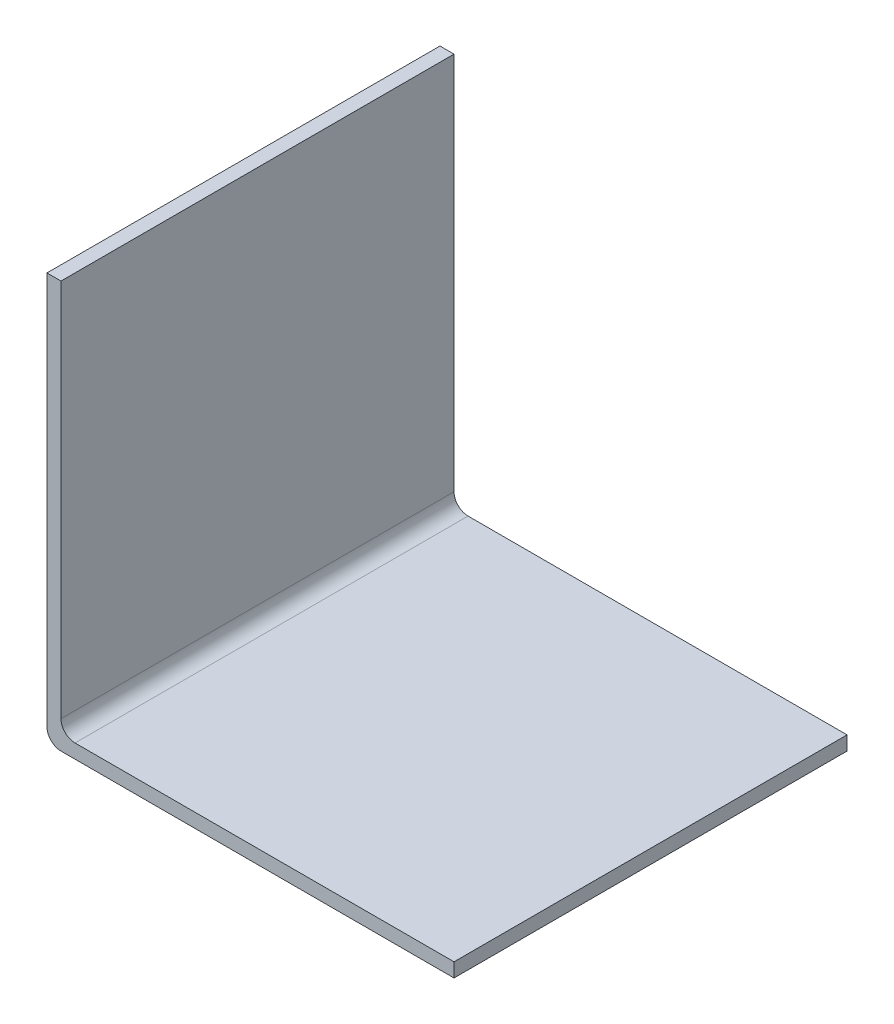
ISO-10303-21;
HEADER;
FILE_DESCRIPTION(('STEP AP214'),'2;1');
FILE_NAME('part.step','',(''),(''),'','','');
FILE_SCHEMA(('AUTOMOTIVE_DESIGN { 1 0 10303 214 1 1 1 1 }'));
ENDSEC;
DATA;
#1=APPLICATION_CONTEXT('core data for automotive mechanical design processes');
#2=APPLICATION_PROTOCOL_DEFINITION('international standard','automotive_design',2000,#1);
#3=PRODUCT_CONTEXT('',#1,'mechanical');
#4=PRODUCT('Part','Part','',(#3));
#5=PRODUCT_RELATED_PRODUCT_CATEGORY('part','',(#4));
#6=PRODUCT_DEFINITION_FORMATION('','',#4);
#7=PRODUCT_DEFINITION_CONTEXT('part definition',#1,'design');
#8=PRODUCT_DEFINITION('design','',#6,#7);
#9=PRODUCT_DEFINITION_SHAPE('','',#8);
#10=(LENGTH_UNIT() NAMED_UNIT(*) SI_UNIT(.MILLI.,.METRE.));
#11=(NAMED_UNIT(*) PLANE_ANGLE_UNIT() SI_UNIT($,.RADIAN.));
#12=(NAMED_UNIT(*) SI_UNIT($,.STERADIAN.) SOLID_ANGLE_UNIT());
#13=UNCERTAINTY_MEASURE_WITH_UNIT(LENGTH_MEASURE(1.E-05),#10,'distance_accuracy_value','');
#14=(GEOMETRIC_REPRESENTATION_CONTEXT(3) GLOBAL_UNCERTAINTY_ASSIGNED_CONTEXT((#13)) GLOBAL_UNIT_ASSIGNED_CONTEXT((#10,
#11,#12)) REPRESENTATION_CONTEXT('',''));
#15=CARTESIAN_POINT('',(0.,0.,0.));
#16=DIRECTION('',(0.,0.,1.));
#17=DIRECTION('',(1.,0.,0.));
#18=AXIS2_PLACEMENT_3D('',#15,#16,#17);
#19=CARTESIAN_POINT('',(0.,-1.,28.));
#20=DIRECTION('',(0.,1.,0.));
#21=DIRECTION('',(0.,0.,1.));
#22=AXIS2_PLACEMENT_3D('',#19,#20,#21);
#23=PLANE('',#22);
#24=DIRECTION('',(1.,0.,0.));
#25=VECTOR('',#24,1.);
#26=CARTESIAN_POINT('',(0.,-1.,28.));
#27=LINE('',#26,#25);
#28=CARTESIAN_POINT('',(0.,-1.,28.));
#29=VERTEX_POINT('',#28);
#30=CARTESIAN_POINT('',(28.,-1.,28.));
#31=VERTEX_POINT('',#30);
#32=EDGE_CURVE('E103',#29,#31,#27,.T.);
#33=ORIENTED_EDGE('',*,*,#32,.F.);
#34=DIRECTION('',(0.,0.,-1.));
#35=VECTOR('',#34,1.);
#36=CARTESIAN_POINT('',(0.,-1.,28.));
#37=LINE('',#36,#35);
#38=CARTESIAN_POINT('',(0.,-1.,0.));
#39=VERTEX_POINT('',#38);
#40=EDGE_CURVE('E125',#29,#39,#37,.T.);
#41=ORIENTED_EDGE('',*,*,#40,.T.);
#42=DIRECTION('',(1.,0.,0.));
#43=VECTOR('',#42,1.);
#44=CARTESIAN_POINT('',(0.,-1.,0.));
#45=LINE('',#44,#43);
#46=CARTESIAN_POINT('',(28.,-1.,0.));
#47=VERTEX_POINT('',#46);
#48=EDGE_CURVE('E120',#39,#47,#45,.T.);
#49=ORIENTED_EDGE('',*,*,#48,.T.);
#50=DIRECTION('',(0.,0.,-1.));
#51=VECTOR('',#50,1.);
#52=CARTESIAN_POINT('',(28.,-1.,28.));
#53=LINE('',#52,#51);
#54=EDGE_CURVE('E118',#31,#47,#53,.T.);
#55=ORIENTED_EDGE('',*,*,#54,.F.);
#56=EDGE_LOOP('',(#33,#41,#49,#55));
#57=FACE_BOUND('',#56,.T.);
#58=ADVANCED_FACE('F38',(#57),#23,.F.);
#59=CARTESIAN_POINT('',(28.,0.,28.));
#60=DIRECTION('',(1.,0.,0.));
#61=DIRECTION('',(0.,0.,-1.));
#62=AXIS2_PLACEMENT_3D('',#59,#60,#61);
#63=PLANE('',#62);
#64=DIRECTION('',(0.,-1.,0.));
#65=VECTOR('',#64,1.);
#66=CARTESIAN_POINT('',(28.,0.,0.));
#67=LINE('',#66,#65);
#68=CARTESIAN_POINT('',(28.,0.,0.));
#69=VERTEX_POINT('',#68);
#70=EDGE_CURVE('E150',#69,#47,#67,.T.);
#71=ORIENTED_EDGE('',*,*,#70,.F.);
#72=DIRECTION('',(0.,0.,-1.));
#73=VECTOR('',#72,1.);
#74=CARTESIAN_POINT('',(28.,0.,28.));
#75=LINE('',#74,#73);
#76=CARTESIAN_POINT('',(28.,0.,28.));
#77=VERTEX_POINT('',#76);
#78=EDGE_CURVE('E126',#77,#69,#75,.T.);
#79=ORIENTED_EDGE('',*,*,#78,.F.);
#80=DIRECTION('',(0.,-1.,0.));
#81=VECTOR('',#80,1.);
#82=CARTESIAN_POINT('',(28.,0.,28.));
#83=LINE('',#82,#81);
#84=EDGE_CURVE('E108',#77,#31,#83,.T.);
#85=ORIENTED_EDGE('',*,*,#84,.T.);
#86=ORIENTED_EDGE('',*,*,#54,.T.);
#87=EDGE_LOOP('',(#71,#79,#85,#86));
#88=FACE_BOUND('',#87,.T.);
#89=ADVANCED_FACE('F129',(#88),#63,.T.);
#90=CARTESIAN_POINT('',(0.,0.,28.));
#91=DIRECTION('',(0.,1.,0.));
#92=DIRECTION('',(0.,0.,1.));
#93=AXIS2_PLACEMENT_3D('',#90,#91,#92);
#94=PLANE('',#93);
#95=DIRECTION('',(1.,0.,0.));
#96=VECTOR('',#95,1.);
#97=CARTESIAN_POINT('',(0.,0.,0.));
#98=LINE('',#97,#96);
#99=CARTESIAN_POINT('',(1.,0.,0.));
#100=VERTEX_POINT('',#99);
#101=EDGE_CURVE('E153',#100,#69,#98,.T.);
#102=ORIENTED_EDGE('',*,*,#101,.F.);
#103=DIRECTION('',(0.,0.,-1.));
#104=VECTOR('',#103,1.);
#105=CARTESIAN_POINT('',(1.,0.,28.));
#106=LINE('',#105,#104);
#107=CARTESIAN_POINT('',(1.,0.,28.));
#108=VERTEX_POINT('',#107);
#109=EDGE_CURVE('E60',#100,#108,#106,.F.);
#110=ORIENTED_EDGE('',*,*,#109,.T.);
#111=DIRECTION('',(1.,0.,0.));
#112=VECTOR('',#111,1.);
#113=CARTESIAN_POINT('',(0.,0.,28.));
#114=LINE('',#113,#112);
#115=EDGE_CURVE('E132',#108,#77,#114,.T.);
#116=ORIENTED_EDGE('',*,*,#115,.T.);
#117=ORIENTED_EDGE('',*,*,#78,.T.);
#118=EDGE_LOOP('',(#102,#110,#116,#117));
#119=FACE_BOUND('',#118,.T.);
#120=ADVANCED_FACE('F195',(#119),#94,.T.);
#121=CARTESIAN_POINT('',(0.,28.,28.));
#122=DIRECTION('',(1.,0.,0.));
#123=DIRECTION('',(0.,1.,0.));
#124=AXIS2_PLACEMENT_3D('',#121,#122,#123);
#125=PLANE('',#124);
#126=DIRECTION('',(0.,-1.,0.));
#127=VECTOR('',#126,1.);
#128=CARTESIAN_POINT('',(0.,28.,28.));
#129=LINE('',#128,#127);
#130=CARTESIAN_POINT('',(0.,28.,28.));
#131=VERTEX_POINT('',#130);
#132=CARTESIAN_POINT('',(0.,1.,28.));
#133=VERTEX_POINT('',#132);
#134=EDGE_CURVE('E135',#131,#133,#129,.T.);
#135=ORIENTED_EDGE('',*,*,#134,.T.);
#136=DIRECTION('',(0.,0.,-1.));
#137=VECTOR('',#136,1.);
#138=CARTESIAN_POINT('',(0.,1.,0.));
#139=LINE('',#138,#137);
#140=CARTESIAN_POINT('',(0.,1.,0.));
#141=VERTEX_POINT('',#140);
#142=EDGE_CURVE('E184',#133,#141,#139,.T.);
#143=ORIENTED_EDGE('',*,*,#142,.T.);
#144=DIRECTION('',(0.,-1.,0.));
#145=VECTOR('',#144,1.);
#146=CARTESIAN_POINT('',(0.,28.,0.));
#147=LINE('',#146,#145);
#148=CARTESIAN_POINT('',(0.,28.,0.));
#149=VERTEX_POINT('',#148);
#150=EDGE_CURVE('E156',#149,#141,#147,.T.);
#151=ORIENTED_EDGE('',*,*,#150,.F.);
#152=DIRECTION('',(0.,0.,-1.));
#153=VECTOR('',#152,1.);
#154=CARTESIAN_POINT('',(0.,28.,28.));
#155=LINE('',#154,#153);
#156=EDGE_CURVE('E169',#131,#149,#155,.T.);
#157=ORIENTED_EDGE('',*,*,#156,.F.);
#158=EDGE_LOOP('',(#135,#143,#151,#157));
#159=FACE_BOUND('',#158,.T.);
#160=ADVANCED_FACE('F197',(#159),#125,.T.);
#161=CARTESIAN_POINT('',(-1.,28.,28.));
#162=DIRECTION('',(0.,1.,0.));
#163=DIRECTION('',(0.,0.,1.));
#164=AXIS2_PLACEMENT_3D('',#161,#162,#163);
#165=PLANE('',#164);
#166=DIRECTION('',(1.,0.,0.));
#167=VECTOR('',#166,1.);
#168=CARTESIAN_POINT('',(-1.,28.,0.));
#169=LINE('',#168,#167);
#170=CARTESIAN_POINT('',(-1.,28.,0.));
#171=VERTEX_POINT('',#170);
#172=EDGE_CURVE('E160',#171,#149,#169,.T.);
#173=ORIENTED_EDGE('',*,*,#172,.F.);
#174=DIRECTION('',(0.,0.,-1.));
#175=VECTOR('',#174,1.);
#176=CARTESIAN_POINT('',(-1.,28.,28.));
#177=LINE('',#176,#175);
#178=CARTESIAN_POINT('',(-1.,28.,28.));
#179=VERTEX_POINT('',#178);
#180=EDGE_CURVE('E147',#179,#171,#177,.T.);
#181=ORIENTED_EDGE('',*,*,#180,.F.);
#182=DIRECTION('',(1.,0.,0.));
#183=VECTOR('',#182,1.);
#184=CARTESIAN_POINT('',(-1.,28.,28.));
#185=LINE('',#184,#183);
#186=EDGE_CURVE('E140',#179,#131,#185,.T.);
#187=ORIENTED_EDGE('',*,*,#186,.T.);
#188=ORIENTED_EDGE('',*,*,#156,.T.);
#189=EDGE_LOOP('',(#173,#181,#187,#188));
#190=FACE_BOUND('',#189,.T.);
#191=ADVANCED_FACE('F201',(#190),#165,.T.);
#192=CARTESIAN_POINT('',(-1.,28.,28.));
#193=DIRECTION('',(1.,0.,0.));
#194=DIRECTION('',(0.,1.,0.));
#195=AXIS2_PLACEMENT_3D('',#192,#193,#194);
#196=PLANE('',#195);
#197=DIRECTION('',(0.,-1.,0.));
#198=VECTOR('',#197,1.);
#199=CARTESIAN_POINT('',(-1.,28.,0.));
#200=LINE('',#199,#198);
#201=CARTESIAN_POINT('',(-1.,0.,0.));
#202=VERTEX_POINT('',#201);
#203=EDGE_CURVE('E115',#171,#202,#200,.T.);
#204=ORIENTED_EDGE('',*,*,#203,.T.);
#205=DIRECTION('',(0.,0.,-1.));
#206=VECTOR('',#205,1.);
#207=CARTESIAN_POINT('',(-1.,0.,28.));
#208=LINE('',#207,#206);
#209=CARTESIAN_POINT('',(-1.,0.,28.));
#210=VERTEX_POINT('',#209);
#211=EDGE_CURVE('E179',#202,#210,#208,.F.);
#212=ORIENTED_EDGE('',*,*,#211,.T.);
#213=DIRECTION('',(0.,-1.,0.));
#214=VECTOR('',#213,1.);
#215=CARTESIAN_POINT('',(-1.,28.,28.));
#216=LINE('',#215,#214);
#217=EDGE_CURVE('E144',#179,#210,#216,.T.);
#218=ORIENTED_EDGE('',*,*,#217,.F.);
#219=ORIENTED_EDGE('',*,*,#180,.T.);
#220=EDGE_LOOP('',(#204,#212,#218,#219));
#221=FACE_BOUND('',#220,.T.);
#222=ADVANCED_FACE('F205',(#221),#196,.F.);
#223=CARTESIAN_POINT('',(0.,0.,28.));
#224=DIRECTION('',(0.,0.,-1.));
#225=DIRECTION('',(-1.,0.,0.));
#226=AXIS2_PLACEMENT_3D('',#223,#224,#225);
#227=PLANE('',#226);
#228=ORIENTED_EDGE('',*,*,#217,.T.);
#229=CARTESIAN_POINT('',(0.,0.,28.));
#230=DIRECTION('',(0.,0.,-1.));
#231=DIRECTION('',(-1.,0.,0.));
#232=AXIS2_PLACEMENT_3D('',#229,#230,#231);
#233=CIRCLE('',#232,1.);
#234=EDGE_CURVE('E110',#210,#29,#233,.F.);
#235=ORIENTED_EDGE('',*,*,#234,.T.);
#236=ORIENTED_EDGE('',*,*,#32,.T.);
#237=ORIENTED_EDGE('',*,*,#84,.F.);
#238=ORIENTED_EDGE('',*,*,#115,.F.);
#239=CARTESIAN_POINT('',(1.,1.,28.));
#240=DIRECTION('',(0.,0.,-1.));
#241=DIRECTION('',(-1.,0.,0.));
#242=AXIS2_PLACEMENT_3D('',#239,#240,#241);
#243=CIRCLE('',#242,1.);
#244=EDGE_CURVE('E11',#108,#133,#243,.T.);
#245=ORIENTED_EDGE('',*,*,#244,.T.);
#246=ORIENTED_EDGE('',*,*,#134,.F.);
#247=ORIENTED_EDGE('',*,*,#186,.F.);
#248=EDGE_LOOP('',(#228,#235,#236,#237,#238,#245,#246,#247));
#249=FACE_BOUND('',#248,.T.);
#250=ADVANCED_FACE('F106',(#249),#227,.F.);
#251=CARTESIAN_POINT('',(0.,0.,0.));
#252=DIRECTION('',(0.,0.,-1.));
#253=DIRECTION('',(-1.,0.,0.));
#254=AXIS2_PLACEMENT_3D('',#251,#252,#253);
#255=PLANE('',#254);
#256=ORIENTED_EDGE('',*,*,#48,.F.);
#257=CARTESIAN_POINT('',(0.,0.,0.));
#258=DIRECTION('',(0.,0.,-1.));
#259=DIRECTION('',(-1.,0.,0.));
#260=AXIS2_PLACEMENT_3D('',#257,#258,#259);
#261=CIRCLE('',#260,1.);
#262=EDGE_CURVE('E176',#39,#202,#261,.T.);
#263=ORIENTED_EDGE('',*,*,#262,.T.);
#264=ORIENTED_EDGE('',*,*,#203,.F.);
#265=ORIENTED_EDGE('',*,*,#172,.T.);
#266=ORIENTED_EDGE('',*,*,#150,.T.);
#267=CARTESIAN_POINT('',(1.,1.,0.));
#268=DIRECTION('',(0.,0.,-1.));
#269=DIRECTION('',(-1.,0.,0.));
#270=AXIS2_PLACEMENT_3D('',#267,#268,#269);
#271=CIRCLE('',#270,1.);
#272=EDGE_CURVE('E47',#141,#100,#271,.F.);
#273=ORIENTED_EDGE('',*,*,#272,.T.);
#274=ORIENTED_EDGE('',*,*,#101,.T.);
#275=ORIENTED_EDGE('',*,*,#70,.T.);
#276=EDGE_LOOP('',(#256,#263,#264,#265,#266,#273,#274,#275));
#277=FACE_BOUND('',#276,.T.);
#278=ADVANCED_FACE('F191',(#277),#255,.T.);
#279=CARTESIAN_POINT('',(0.,0.,28.));
#280=DIRECTION('',(0.,0.,-1.));
#281=DIRECTION('',(-1.,0.,0.));
#282=AXIS2_PLACEMENT_3D('',#279,#280,#281);
#283=CYLINDRICAL_SURFACE('',#282,1.);
#284=ORIENTED_EDGE('',*,*,#234,.F.);
#285=ORIENTED_EDGE('',*,*,#211,.F.);
#286=ORIENTED_EDGE('',*,*,#262,.F.);
#287=ORIENTED_EDGE('',*,*,#40,.F.);
#288=EDGE_LOOP('',(#284,#285,#286,#287));
#289=FACE_BOUND('',#288,.T.);
#290=ADVANCED_FACE('F208',(#289),#283,.T.);
#291=CARTESIAN_POINT('',(1.,1.,28.));
#292=DIRECTION('',(0.,0.,1.));
#293=DIRECTION('',(1.,0.,0.));
#294=AXIS2_PLACEMENT_3D('',#291,#292,#293);
#295=CYLINDRICAL_SURFACE('',#294,1.);
#296=ORIENTED_EDGE('',*,*,#244,.F.);
#297=ORIENTED_EDGE('',*,*,#109,.F.);
#298=ORIENTED_EDGE('',*,*,#272,.F.);
#299=ORIENTED_EDGE('',*,*,#142,.F.);
#300=EDGE_LOOP('',(#296,#297,#298,#299));
#301=FACE_BOUND('',#300,.T.);
#302=ADVANCED_FACE('F40',(#301),#295,.F.);
#303=CLOSED_SHELL('',(#58,#89,#120,#160,#191,#222,#250,#278,#290,#302));
#304=MANIFOLD_SOLID_BREP('B2',#303);
#305=ADVANCED_BREP_SHAPE_REPRESENTATION('',(#18,#304),#14);
#306=SHAPE_DEFINITION_REPRESENTATION(#9,#305);
ENDSEC;
END-ISO-10303-21;
